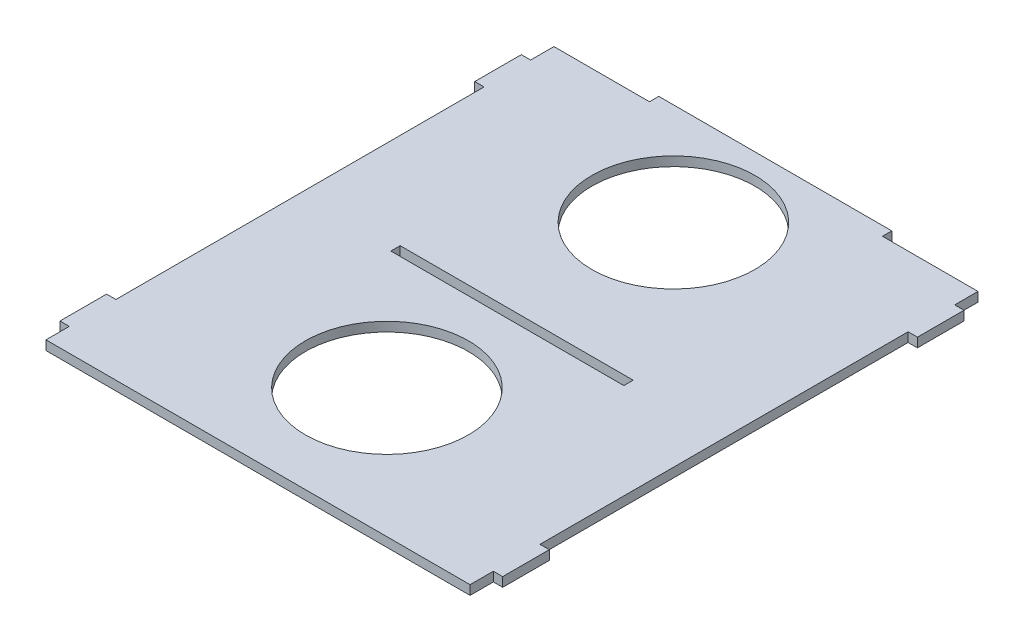
ISO-10303-21;
HEADER;
FILE_DESCRIPTION(('STEP AP214'),'2;1');
FILE_NAME('part.step','',(''),(''),'','','');
FILE_SCHEMA(('AUTOMOTIVE_DESIGN { 1 0 10303 214 1 1 1 1 }'));
ENDSEC;
DATA;
#1=APPLICATION_CONTEXT('core data for automotive mechanical design processes');
#2=APPLICATION_PROTOCOL_DEFINITION('international standard','automotive_design',2000,#1);
#3=PRODUCT_CONTEXT('',#1,'mechanical');
#4=PRODUCT('Part','Part','',(#3));
#5=PRODUCT_RELATED_PRODUCT_CATEGORY('part','',(#4));
#6=PRODUCT_DEFINITION_FORMATION('','',#4);
#7=PRODUCT_DEFINITION_CONTEXT('part definition',#1,'design');
#8=PRODUCT_DEFINITION('design','',#6,#7);
#9=PRODUCT_DEFINITION_SHAPE('','',#8);
#10=(LENGTH_UNIT() NAMED_UNIT(*) SI_UNIT(.MILLI.,.METRE.));
#11=(NAMED_UNIT(*) PLANE_ANGLE_UNIT() SI_UNIT($,.RADIAN.));
#12=(NAMED_UNIT(*) SI_UNIT($,.STERADIAN.) SOLID_ANGLE_UNIT());
#13=UNCERTAINTY_MEASURE_WITH_UNIT(LENGTH_MEASURE(1.E-05),#10,'distance_accuracy_value','');
#14=(GEOMETRIC_REPRESENTATION_CONTEXT(3) GLOBAL_UNCERTAINTY_ASSIGNED_CONTEXT((#13)) GLOBAL_UNIT_ASSIGNED_CONTEXT((#10,
#11,#12)) REPRESENTATION_CONTEXT('',''));
#15=CARTESIAN_POINT('',(0.,0.,0.));
#16=DIRECTION('',(0.,0.,1.));
#17=DIRECTION('',(1.,0.,0.));
#18=AXIS2_PLACEMENT_3D('',#15,#16,#17);
#19=CARTESIAN_POINT('',(0.,4.,0.));
#20=DIRECTION('',(0.,-1.,0.));
#21=DIRECTION('',(0.,0.,-1.));
#22=AXIS2_PLACEMENT_3D('',#19,#20,#21);
#23=PLANE('',#22);
#24=DIRECTION('',(0.,0.,1.));
#25=VECTOR('',#24,1.);
#26=CARTESIAN_POINT('',(-90.9999999999996,4.,-70.0000000000444));
#27=LINE('',#26,#25);
#28=CARTESIAN_POINT('',(-90.9999999999996,4.,-80.000000000045));
#29=VERTEX_POINT('',#28);
#30=CARTESIAN_POINT('',(-90.9999999999996,4.,-70.0000000000444));
#31=VERTEX_POINT('',#30);
#32=EDGE_CURVE('E260',#29,#31,#27,.T.);
#33=ORIENTED_EDGE('',*,*,#32,.T.);
#34=DIRECTION('',(-1.,0.,0.));
#35=VECTOR('',#34,1.);
#36=CARTESIAN_POINT('',(-90.9999999999996,4.,-70.0000000000444));
#37=LINE('',#36,#35);
#38=CARTESIAN_POINT('',(-95.,4.,-70.0000000000444));
#39=VERTEX_POINT('',#38);
#40=EDGE_CURVE('E263',#31,#39,#37,.T.);
#41=ORIENTED_EDGE('',*,*,#40,.T.);
#42=DIRECTION('',(0.,0.,1.));
#43=VECTOR('',#42,1.);
#44=CARTESIAN_POINT('',(-95.,4.,-70.0000000000444));
#45=LINE('',#44,#43);
#46=CARTESIAN_POINT('',(-95.,4.,-50.0000000000446));
#47=VERTEX_POINT('',#46);
#48=EDGE_CURVE('E266',#39,#47,#45,.T.);
#49=ORIENTED_EDGE('',*,*,#48,.T.);
#50=DIRECTION('',(1.,0.,0.));
#51=VECTOR('',#50,1.);
#52=CARTESIAN_POINT('',(-95.,4.,-50.0000000000446));
#53=LINE('',#52,#51);
#54=CARTESIAN_POINT('',(-90.9999999999996,4.,-50.0000000000446));
#55=VERTEX_POINT('',#54);
#56=EDGE_CURVE('E268',#47,#55,#53,.T.);
#57=ORIENTED_EDGE('',*,*,#56,.T.);
#58=DIRECTION('',(0.,0.,1.));
#59=VECTOR('',#58,1.);
#60=CARTESIAN_POINT('',(-90.9999999999996,4.,107.999999999955));
#61=LINE('',#60,#59);
#62=CARTESIAN_POINT('',(-90.9999999999996,4.,107.999999999955));
#63=VERTEX_POINT('',#62);
#64=EDGE_CURVE('E270',#55,#63,#61,.T.);
#65=ORIENTED_EDGE('',*,*,#64,.T.);
#66=DIRECTION('',(-1.,0.,0.));
#67=VECTOR('',#66,1.);
#68=CARTESIAN_POINT('',(-90.9999999999996,4.,107.999999999955));
#69=LINE('',#68,#67);
#70=CARTESIAN_POINT('',(-94.9999999999999,4.,107.999999999955));
#71=VERTEX_POINT('',#70);
#72=EDGE_CURVE('E272',#63,#71,#69,.T.);
#73=ORIENTED_EDGE('',*,*,#72,.T.);
#74=DIRECTION('',(0.,0.,1.));
#75=VECTOR('',#74,1.);
#76=CARTESIAN_POINT('',(-94.9999999999999,4.,107.999999999955));
#77=LINE('',#76,#75);
#78=CARTESIAN_POINT('',(-94.9999999999999,4.,127.999999999955));
#79=VERTEX_POINT('',#78);
#80=EDGE_CURVE('E274',#71,#79,#77,.T.);
#81=ORIENTED_EDGE('',*,*,#80,.T.);
#82=DIRECTION('',(1.,0.,0.));
#83=VECTOR('',#82,1.);
#84=CARTESIAN_POINT('',(-94.9999999999999,4.,127.999999999955));
#85=LINE('',#84,#83);
#86=CARTESIAN_POINT('',(-90.9999999999996,4.,127.999999999955));
#87=VERTEX_POINT('',#86);
#88=EDGE_CURVE('E276',#79,#87,#85,.T.);
#89=ORIENTED_EDGE('',*,*,#88,.T.);
#90=DIRECTION('',(0.,0.,1.));
#91=VECTOR('',#90,1.);
#92=CARTESIAN_POINT('',(-90.9999999999996,4.,137.999999999955));
#93=LINE('',#92,#91);
#94=CARTESIAN_POINT('',(-90.9999999999996,4.,137.999999999955));
#95=VERTEX_POINT('',#94);
#96=EDGE_CURVE('E278',#87,#95,#93,.T.);
#97=ORIENTED_EDGE('',*,*,#96,.T.);
#98=DIRECTION('',(1.,0.,0.));
#99=VECTOR('',#98,1.);
#100=CARTESIAN_POINT('',(-90.9999999999996,4.,137.999999999955));
#101=LINE('',#100,#99);
#102=CARTESIAN_POINT('',(90.9999999999996,4.,137.999999999955));
#103=VERTEX_POINT('',#102);
#104=EDGE_CURVE('E280',#95,#103,#101,.T.);
#105=ORIENTED_EDGE('',*,*,#104,.T.);
#106=DIRECTION('',(0.,0.,-1.));
#107=VECTOR('',#106,1.);
#108=CARTESIAN_POINT('',(90.9999999999996,4.,137.999999999955));
#109=LINE('',#108,#107);
#110=CARTESIAN_POINT('',(90.9999999999996,4.,127.999999999955));
#111=VERTEX_POINT('',#110);
#112=EDGE_CURVE('E282',#103,#111,#109,.T.);
#113=ORIENTED_EDGE('',*,*,#112,.T.);
#114=DIRECTION('',(1.,0.,0.));
#115=VECTOR('',#114,1.);
#116=CARTESIAN_POINT('',(95.,4.,127.999999999955));
#117=LINE('',#116,#115);
#118=CARTESIAN_POINT('',(95.,4.,127.999999999955));
#119=VERTEX_POINT('',#118);
#120=EDGE_CURVE('E284',#111,#119,#117,.T.);
#121=ORIENTED_EDGE('',*,*,#120,.T.);
#122=DIRECTION('',(0.,0.,-1.));
#123=VECTOR('',#122,1.);
#124=CARTESIAN_POINT('',(95.,4.,107.999999999955));
#125=LINE('',#124,#123);
#126=CARTESIAN_POINT('',(95.,4.,107.999999999955));
#127=VERTEX_POINT('',#126);
#128=EDGE_CURVE('E286',#119,#127,#125,.T.);
#129=ORIENTED_EDGE('',*,*,#128,.T.);
#130=DIRECTION('',(-1.,0.,0.));
#131=VECTOR('',#130,1.);
#132=CARTESIAN_POINT('',(90.9999999999996,4.,107.999999999955));
#133=LINE('',#132,#131);
#134=CARTESIAN_POINT('',(90.9999999999996,4.,107.999999999955));
#135=VERTEX_POINT('',#134);
#136=EDGE_CURVE('E288',#127,#135,#133,.T.);
#137=ORIENTED_EDGE('',*,*,#136,.T.);
#138=DIRECTION('',(0.,0.,-1.));
#139=VECTOR('',#138,1.);
#140=CARTESIAN_POINT('',(90.9999999999996,4.,107.999999999955));
#141=LINE('',#140,#139);
#142=CARTESIAN_POINT('',(90.9999999999996,4.,-50.0000000000446));
#143=VERTEX_POINT('',#142);
#144=EDGE_CURVE('E290',#135,#143,#141,.T.);
#145=ORIENTED_EDGE('',*,*,#144,.T.);
#146=DIRECTION('',(1.,0.,0.));
#147=VECTOR('',#146,1.);
#148=CARTESIAN_POINT('',(95.,4.,-50.0000000000446));
#149=LINE('',#148,#147);
#150=CARTESIAN_POINT('',(95.,4.,-50.0000000000446));
#151=VERTEX_POINT('',#150);
#152=EDGE_CURVE('E292',#143,#151,#149,.T.);
#153=ORIENTED_EDGE('',*,*,#152,.T.);
#154=DIRECTION('',(0.,0.,-1.));
#155=VECTOR('',#154,1.);
#156=CARTESIAN_POINT('',(95.,4.,-70.0000000000444));
#157=LINE('',#156,#155);
#158=CARTESIAN_POINT('',(95.,4.,-70.0000000000444));
#159=VERTEX_POINT('',#158);
#160=EDGE_CURVE('E294',#151,#159,#157,.T.);
#161=ORIENTED_EDGE('',*,*,#160,.T.);
#162=DIRECTION('',(-1.,0.,0.));
#163=VECTOR('',#162,1.);
#164=CARTESIAN_POINT('',(90.9999999999996,4.,-70.0000000000444));
#165=LINE('',#164,#163);
#166=CARTESIAN_POINT('',(90.9999999999996,4.,-70.0000000000444));
#167=VERTEX_POINT('',#166);
#168=EDGE_CURVE('E296',#159,#167,#165,.T.);
#169=ORIENTED_EDGE('',*,*,#168,.T.);
#170=DIRECTION('',(0.,0.,-1.));
#171=VECTOR('',#170,1.);
#172=CARTESIAN_POINT('',(90.9999999999996,4.,-70.0000000000444));
#173=LINE('',#172,#171);
#174=CARTESIAN_POINT('',(90.9999999999996,4.,-80.000000000045));
#175=VERTEX_POINT('',#174);
#176=EDGE_CURVE('E298',#167,#175,#173,.T.);
#177=ORIENTED_EDGE('',*,*,#176,.T.);
#178=DIRECTION('',(-1.,0.,0.));
#179=VECTOR('',#178,1.);
#180=CARTESIAN_POINT('',(50.,4.,-80.000000000045));
#181=LINE('',#180,#179);
#182=CARTESIAN_POINT('',(50.,4.,-80.000000000045));
#183=VERTEX_POINT('',#182);
#184=EDGE_CURVE('E300',#175,#183,#181,.T.);
#185=ORIENTED_EDGE('',*,*,#184,.T.);
#186=DIRECTION('',(0.,0.,-1.));
#187=VECTOR('',#186,1.);
#188=CARTESIAN_POINT('',(50.,4.,-84.000000000045));
#189=LINE('',#188,#187);
#190=CARTESIAN_POINT('',(50.,4.,-84.000000000045));
#191=VERTEX_POINT('',#190);
#192=EDGE_CURVE('E302',#183,#191,#189,.T.);
#193=ORIENTED_EDGE('',*,*,#192,.T.);
#194=DIRECTION('',(-1.,0.,0.));
#195=VECTOR('',#194,1.);
#196=CARTESIAN_POINT('',(-50.,4.,-84.000000000045));
#197=LINE('',#196,#195);
#198=CARTESIAN_POINT('',(-50.,4.,-84.000000000045));
#199=VERTEX_POINT('',#198);
#200=EDGE_CURVE('E304',#191,#199,#197,.T.);
#201=ORIENTED_EDGE('',*,*,#200,.T.);
#202=DIRECTION('',(0.,0.,1.));
#203=VECTOR('',#202,1.);
#204=CARTESIAN_POINT('',(-50.,4.,-84.000000000045));
#205=LINE('',#204,#203);
#206=CARTESIAN_POINT('',(-50.,4.,-80.000000000045));
#207=VERTEX_POINT('',#206);
#208=EDGE_CURVE('E306',#199,#207,#205,.T.);
#209=ORIENTED_EDGE('',*,*,#208,.T.);
#210=DIRECTION('',(-1.,0.,0.));
#211=VECTOR('',#210,1.);
#212=CARTESIAN_POINT('',(-90.9999999999996,4.,-80.000000000045));
#213=LINE('',#212,#211);
#214=EDGE_CURVE('E308',#207,#29,#213,.T.);
#215=ORIENTED_EDGE('',*,*,#214,.T.);
#216=EDGE_LOOP('',(#33,#41,#49,#57,#65,#73,#81,#89,#97,#105,#113,#121,#129,#137,#145,#153,#161,
#169,#177,#185,#193,#201,#209,#215));
#217=FACE_BOUND('',#216,.T.);
#218=DIRECTION('',(0.,0.,1.));
#219=VECTOR('',#218,1.);
#220=CARTESIAN_POINT('',(-50.,4.,26.9999999999551));
#221=LINE('',#220,#219);
#222=CARTESIAN_POINT('',(-50.,4.,26.9999999999551));
#223=VERTEX_POINT('',#222);
#224=CARTESIAN_POINT('',(-50.,4.,30.9999999999551));
#225=VERTEX_POINT('',#224);
#226=EDGE_CURVE('E221',#223,#225,#221,.T.);
#227=ORIENTED_EDGE('',*,*,#226,.F.);
#228=DIRECTION('',(-1.,0.,0.));
#229=VECTOR('',#228,1.);
#230=CARTESIAN_POINT('',(-50.,4.,26.9999999999551));
#231=LINE('',#230,#229);
#232=CARTESIAN_POINT('',(50.,4.,26.9999999999551));
#233=VERTEX_POINT('',#232);
#234=EDGE_CURVE('E244',#233,#223,#231,.T.);
#235=ORIENTED_EDGE('',*,*,#234,.F.);
#236=DIRECTION('',(0.,0.,-1.));
#237=VECTOR('',#236,1.);
#238=CARTESIAN_POINT('',(50.,4.,26.9999999999551));
#239=LINE('',#238,#237);
#240=CARTESIAN_POINT('',(50.,4.,30.9999999999551));
#241=VERTEX_POINT('',#240);
#242=EDGE_CURVE('E242',#241,#233,#239,.T.);
#243=ORIENTED_EDGE('',*,*,#242,.F.);
#244=DIRECTION('',(1.,0.,0.));
#245=VECTOR('',#244,1.);
#246=CARTESIAN_POINT('',(-50.,4.,30.9999999999551));
#247=LINE('',#246,#245);
#248=EDGE_CURVE('E229',#225,#241,#247,.T.);
#249=ORIENTED_EDGE('',*,*,#248,.F.);
#250=EDGE_LOOP('',(#227,#235,#243,#249));
#251=FACE_BOUND('',#250,.T.);
#252=CARTESIAN_POINT('',(0.,4.,-40.2612435585554));
#253=DIRECTION('',(0.,1.,0.));
#254=DIRECTION('',(0.,0.,1.));
#255=AXIS2_PLACEMENT_3D('',#252,#253,#254);
#256=CIRCLE('',#255,35.);
#257=CARTESIAN_POINT('',(0.,4.,-5.26124355855541));
#258=VERTEX_POINT('',#257);
#259=EDGE_CURVE('E250',#258,#258,#256,.T.);
#260=ORIENTED_EDGE('',*,*,#259,.F.);
#261=EDGE_LOOP('',(#260));
#262=FACE_BOUND('',#261,.T.);
#263=CARTESIAN_POINT('',(-1.94289029309402E-13,4.,82.6829730301782));
#264=DIRECTION('',(0.,1.,0.));
#265=DIRECTION('',(0.,0.,1.));
#266=AXIS2_PLACEMENT_3D('',#263,#264,#265);
#267=CIRCLE('',#266,35.);
#268=CARTESIAN_POINT('',(-1.94289029309402E-13,4.,117.682973030178));
#269=VERTEX_POINT('',#268);
#270=EDGE_CURVE('E809',#269,#269,#267,.T.);
#271=ORIENTED_EDGE('',*,*,#270,.F.);
#272=EDGE_LOOP('',(#271));
#273=FACE_BOUND('',#272,.T.);
#274=ADVANCED_FACE('F36',(#217,#251,#262,#273),#23,.F.);
#275=CARTESIAN_POINT('',(0.,0.,0.));
#276=DIRECTION('',(0.,-1.,0.));
#277=DIRECTION('',(0.,0.,-1.));
#278=AXIS2_PLACEMENT_3D('',#275,#276,#277);
#279=PLANE('',#278);
#280=CARTESIAN_POINT('',(0.,0.,-40.2612435585554));
#281=DIRECTION('',(0.,1.,0.));
#282=DIRECTION('',(0.,0.,1.));
#283=AXIS2_PLACEMENT_3D('',#280,#281,#282);
#284=CIRCLE('',#283,35.);
#285=CARTESIAN_POINT('',(0.,0.,-5.26124355855541));
#286=VERTEX_POINT('',#285);
#287=EDGE_CURVE('E815',#286,#286,#284,.T.);
#288=ORIENTED_EDGE('',*,*,#287,.T.);
#289=EDGE_LOOP('',(#288));
#290=FACE_BOUND('',#289,.T.);
#291=DIRECTION('',(0.,0.,1.));
#292=VECTOR('',#291,1.);
#293=CARTESIAN_POINT('',(-90.9999999999996,0.,-70.0000000000444));
#294=LINE('',#293,#292);
#295=CARTESIAN_POINT('',(-90.9999999999996,0.,-80.000000000045));
#296=VERTEX_POINT('',#295);
#297=CARTESIAN_POINT('',(-90.9999999999996,0.,-70.0000000000444));
#298=VERTEX_POINT('',#297);
#299=EDGE_CURVE('E237',#296,#298,#294,.T.);
#300=ORIENTED_EDGE('',*,*,#299,.F.);
#301=DIRECTION('',(-1.,0.,0.));
#302=VECTOR('',#301,1.);
#303=CARTESIAN_POINT('',(-90.9999999999996,0.,-80.000000000045));
#304=LINE('',#303,#302);
#305=CARTESIAN_POINT('',(-50.,0.,-80.000000000045));
#306=VERTEX_POINT('',#305);
#307=EDGE_CURVE('E264',#306,#296,#304,.T.);
#308=ORIENTED_EDGE('',*,*,#307,.F.);
#309=DIRECTION('',(0.,0.,1.));
#310=VECTOR('',#309,1.);
#311=CARTESIAN_POINT('',(-50.,0.,-84.000000000045));
#312=LINE('',#311,#310);
#313=CARTESIAN_POINT('',(-50.,0.,-84.000000000045));
#314=VERTEX_POINT('',#313);
#315=EDGE_CURVE('E355',#314,#306,#312,.T.);
#316=ORIENTED_EDGE('',*,*,#315,.F.);
#317=DIRECTION('',(-1.,0.,0.));
#318=VECTOR('',#317,1.);
#319=CARTESIAN_POINT('',(-50.,0.,-84.000000000045));
#320=LINE('',#319,#318);
#321=CARTESIAN_POINT('',(50.,0.,-84.000000000045));
#322=VERTEX_POINT('',#321);
#323=EDGE_CURVE('E353',#322,#314,#320,.T.);
#324=ORIENTED_EDGE('',*,*,#323,.F.);
#325=DIRECTION('',(0.,0.,-1.));
#326=VECTOR('',#325,1.);
#327=CARTESIAN_POINT('',(50.,0.,-84.000000000045));
#328=LINE('',#327,#326);
#329=CARTESIAN_POINT('',(50.,0.,-80.000000000045));
#330=VERTEX_POINT('',#329);
#331=EDGE_CURVE('E351',#330,#322,#328,.T.);
#332=ORIENTED_EDGE('',*,*,#331,.F.);
#333=DIRECTION('',(-1.,0.,0.));
#334=VECTOR('',#333,1.);
#335=CARTESIAN_POINT('',(50.,0.,-80.000000000045));
#336=LINE('',#335,#334);
#337=CARTESIAN_POINT('',(90.9999999999996,0.,-80.000000000045));
#338=VERTEX_POINT('',#337);
#339=EDGE_CURVE('E349',#338,#330,#336,.T.);
#340=ORIENTED_EDGE('',*,*,#339,.F.);
#341=DIRECTION('',(0.,0.,-1.));
#342=VECTOR('',#341,1.);
#343=CARTESIAN_POINT('',(90.9999999999996,0.,-70.0000000000444));
#344=LINE('',#343,#342);
#345=CARTESIAN_POINT('',(90.9999999999996,0.,-70.0000000000444));
#346=VERTEX_POINT('',#345);
#347=EDGE_CURVE('E347',#346,#338,#344,.T.);
#348=ORIENTED_EDGE('',*,*,#347,.F.);
#349=DIRECTION('',(-1.,0.,0.));
#350=VECTOR('',#349,1.);
#351=CARTESIAN_POINT('',(90.9999999999996,0.,-70.0000000000444));
#352=LINE('',#351,#350);
#353=CARTESIAN_POINT('',(95.,0.,-70.0000000000444));
#354=VERTEX_POINT('',#353);
#355=EDGE_CURVE('E345',#354,#346,#352,.T.);
#356=ORIENTED_EDGE('',*,*,#355,.F.);
#357=DIRECTION('',(0.,0.,-1.));
#358=VECTOR('',#357,1.);
#359=CARTESIAN_POINT('',(95.,0.,-70.0000000000444));
#360=LINE('',#359,#358);
#361=CARTESIAN_POINT('',(95.,0.,-50.0000000000446));
#362=VERTEX_POINT('',#361);
#363=EDGE_CURVE('E343',#362,#354,#360,.T.);
#364=ORIENTED_EDGE('',*,*,#363,.F.);
#365=DIRECTION('',(1.,0.,0.));
#366=VECTOR('',#365,1.);
#367=CARTESIAN_POINT('',(95.,0.,-50.0000000000446));
#368=LINE('',#367,#366);
#369=CARTESIAN_POINT('',(90.9999999999996,0.,-50.0000000000446));
#370=VERTEX_POINT('',#369);
#371=EDGE_CURVE('E341',#370,#362,#368,.T.);
#372=ORIENTED_EDGE('',*,*,#371,.F.);
#373=DIRECTION('',(0.,0.,-1.));
#374=VECTOR('',#373,1.);
#375=CARTESIAN_POINT('',(90.9999999999996,0.,107.999999999955));
#376=LINE('',#375,#374);
#377=CARTESIAN_POINT('',(90.9999999999996,0.,107.999999999955));
#378=VERTEX_POINT('',#377);
#379=EDGE_CURVE('E339',#378,#370,#376,.T.);
#380=ORIENTED_EDGE('',*,*,#379,.F.);
#381=DIRECTION('',(-1.,0.,0.));
#382=VECTOR('',#381,1.);
#383=CARTESIAN_POINT('',(90.9999999999996,0.,107.999999999955));
#384=LINE('',#383,#382);
#385=CARTESIAN_POINT('',(95.,0.,107.999999999955));
#386=VERTEX_POINT('',#385);
#387=EDGE_CURVE('E337',#386,#378,#384,.T.);
#388=ORIENTED_EDGE('',*,*,#387,.F.);
#389=DIRECTION('',(0.,0.,-1.));
#390=VECTOR('',#389,1.);
#391=CARTESIAN_POINT('',(95.,0.,107.999999999955));
#392=LINE('',#391,#390);
#393=CARTESIAN_POINT('',(95.,0.,127.999999999955));
#394=VERTEX_POINT('',#393);
#395=EDGE_CURVE('E335',#394,#386,#392,.T.);
#396=ORIENTED_EDGE('',*,*,#395,.F.);
#397=DIRECTION('',(1.,0.,0.));
#398=VECTOR('',#397,1.);
#399=CARTESIAN_POINT('',(95.,0.,127.999999999955));
#400=LINE('',#399,#398);
#401=CARTESIAN_POINT('',(90.9999999999996,0.,127.999999999955));
#402=VERTEX_POINT('',#401);
#403=EDGE_CURVE('E333',#402,#394,#400,.T.);
#404=ORIENTED_EDGE('',*,*,#403,.F.);
#405=DIRECTION('',(0.,0.,-1.));
#406=VECTOR('',#405,1.);
#407=CARTESIAN_POINT('',(90.9999999999996,0.,137.999999999955));
#408=LINE('',#407,#406);
#409=CARTESIAN_POINT('',(90.9999999999996,0.,137.999999999955));
#410=VERTEX_POINT('',#409);
#411=EDGE_CURVE('E331',#410,#402,#408,.T.);
#412=ORIENTED_EDGE('',*,*,#411,.F.);
#413=DIRECTION('',(1.,0.,0.));
#414=VECTOR('',#413,1.);
#415=CARTESIAN_POINT('',(-90.9999999999996,0.,137.999999999955));
#416=LINE('',#415,#414);
#417=CARTESIAN_POINT('',(-90.9999999999996,0.,137.999999999955));
#418=VERTEX_POINT('',#417);
#419=EDGE_CURVE('E329',#418,#410,#416,.T.);
#420=ORIENTED_EDGE('',*,*,#419,.F.);
#421=DIRECTION('',(0.,0.,1.));
#422=VECTOR('',#421,1.);
#423=CARTESIAN_POINT('',(-90.9999999999996,0.,137.999999999955));
#424=LINE('',#423,#422);
#425=CARTESIAN_POINT('',(-90.9999999999996,0.,127.999999999955));
#426=VERTEX_POINT('',#425);
#427=EDGE_CURVE('E327',#426,#418,#424,.T.);
#428=ORIENTED_EDGE('',*,*,#427,.F.);
#429=DIRECTION('',(1.,0.,0.));
#430=VECTOR('',#429,1.);
#431=CARTESIAN_POINT('',(-94.9999999999999,0.,127.999999999955));
#432=LINE('',#431,#430);
#433=CARTESIAN_POINT('',(-94.9999999999999,0.,127.999999999955));
#434=VERTEX_POINT('',#433);
#435=EDGE_CURVE('E325',#434,#426,#432,.T.);
#436=ORIENTED_EDGE('',*,*,#435,.F.);
#437=DIRECTION('',(0.,0.,1.));
#438=VECTOR('',#437,1.);
#439=CARTESIAN_POINT('',(-94.9999999999999,0.,107.999999999955));
#440=LINE('',#439,#438);
#441=CARTESIAN_POINT('',(-94.9999999999999,0.,107.999999999955));
#442=VERTEX_POINT('',#441);
#443=EDGE_CURVE('E323',#442,#434,#440,.T.);
#444=ORIENTED_EDGE('',*,*,#443,.F.);
#445=DIRECTION('',(-1.,0.,0.));
#446=VECTOR('',#445,1.);
#447=CARTESIAN_POINT('',(-90.9999999999996,0.,107.999999999955));
#448=LINE('',#447,#446);
#449=CARTESIAN_POINT('',(-90.9999999999996,0.,107.999999999955));
#450=VERTEX_POINT('',#449);
#451=EDGE_CURVE('E321',#450,#442,#448,.T.);
#452=ORIENTED_EDGE('',*,*,#451,.F.);
#453=DIRECTION('',(0.,0.,1.));
#454=VECTOR('',#453,1.);
#455=CARTESIAN_POINT('',(-90.9999999999996,0.,107.999999999955));
#456=LINE('',#455,#454);
#457=CARTESIAN_POINT('',(-90.9999999999996,0.,-50.0000000000446));
#458=VERTEX_POINT('',#457);
#459=EDGE_CURVE('E319',#458,#450,#456,.T.);
#460=ORIENTED_EDGE('',*,*,#459,.F.);
#461=DIRECTION('',(1.,0.,0.));
#462=VECTOR('',#461,1.);
#463=CARTESIAN_POINT('',(-95.,0.,-50.0000000000446));
#464=LINE('',#463,#462);
#465=CARTESIAN_POINT('',(-95.,0.,-50.0000000000446));
#466=VERTEX_POINT('',#465);
#467=EDGE_CURVE('E317',#466,#458,#464,.T.);
#468=ORIENTED_EDGE('',*,*,#467,.F.);
#469=DIRECTION('',(0.,0.,1.));
#470=VECTOR('',#469,1.);
#471=CARTESIAN_POINT('',(-95.,0.,-70.0000000000444));
#472=LINE('',#471,#470);
#473=CARTESIAN_POINT('',(-95.,0.,-70.0000000000444));
#474=VERTEX_POINT('',#473);
#475=EDGE_CURVE('E315',#474,#466,#472,.T.);
#476=ORIENTED_EDGE('',*,*,#475,.F.);
#477=DIRECTION('',(-1.,0.,0.));
#478=VECTOR('',#477,1.);
#479=CARTESIAN_POINT('',(-90.9999999999996,0.,-70.0000000000444));
#480=LINE('',#479,#478);
#481=EDGE_CURVE('E313',#298,#474,#480,.T.);
#482=ORIENTED_EDGE('',*,*,#481,.F.);
#483=EDGE_LOOP('',(#300,#308,#316,#324,#332,#340,#348,#356,#364,#372,#380,#388,#396,#404,#412,
#420,#428,#436,#444,#452,#460,#468,#476,#482));
#484=FACE_BOUND('',#483,.T.);
#485=DIRECTION('',(-1.,0.,0.));
#486=VECTOR('',#485,1.);
#487=CARTESIAN_POINT('',(-50.,0.,26.9999999999551));
#488=LINE('',#487,#486);
#489=CARTESIAN_POINT('',(50.,0.,26.9999999999551));
#490=VERTEX_POINT('',#489);
#491=CARTESIAN_POINT('',(-50.,0.,26.9999999999551));
#492=VERTEX_POINT('',#491);
#493=EDGE_CURVE('E230',#490,#492,#488,.T.);
#494=ORIENTED_EDGE('',*,*,#493,.T.);
#495=DIRECTION('',(0.,0.,1.));
#496=VECTOR('',#495,1.);
#497=CARTESIAN_POINT('',(-50.,0.,26.9999999999551));
#498=LINE('',#497,#496);
#499=CARTESIAN_POINT('',(-50.,0.,30.9999999999551));
#500=VERTEX_POINT('',#499);
#501=EDGE_CURVE('E59',#492,#500,#498,.T.);
#502=ORIENTED_EDGE('',*,*,#501,.T.);
#503=DIRECTION('',(1.,0.,0.));
#504=VECTOR('',#503,1.);
#505=CARTESIAN_POINT('',(-50.,0.,30.9999999999551));
#506=LINE('',#505,#504);
#507=CARTESIAN_POINT('',(50.,0.,30.9999999999551));
#508=VERTEX_POINT('',#507);
#509=EDGE_CURVE('E236',#500,#508,#506,.T.);
#510=ORIENTED_EDGE('',*,*,#509,.T.);
#511=DIRECTION('',(0.,0.,-1.));
#512=VECTOR('',#511,1.);
#513=CARTESIAN_POINT('',(50.,0.,26.9999999999551));
#514=LINE('',#513,#512);
#515=EDGE_CURVE('E252',#508,#490,#514,.T.);
#516=ORIENTED_EDGE('',*,*,#515,.T.);
#517=EDGE_LOOP('',(#494,#502,#510,#516));
#518=FACE_BOUND('',#517,.T.);
#519=CARTESIAN_POINT('',(-1.94289029309402E-13,0.,82.6829730301782));
#520=DIRECTION('',(0.,1.,0.));
#521=DIRECTION('',(0.,0.,1.));
#522=AXIS2_PLACEMENT_3D('',#519,#520,#521);
#523=CIRCLE('',#522,35.);
#524=CARTESIAN_POINT('',(-1.94289029309402E-13,0.,117.682973030178));
#525=VERTEX_POINT('',#524);
#526=EDGE_CURVE('E812',#525,#525,#523,.T.);
#527=ORIENTED_EDGE('',*,*,#526,.T.);
#528=EDGE_LOOP('',(#527));
#529=FACE_BOUND('',#528,.T.);
#530=ADVANCED_FACE('F433',(#290,#484,#518,#529),#279,.T.);
#531=CARTESIAN_POINT('',(-90.9999999999996,4.,-70.0000000000444));
#532=DIRECTION('',(1.,0.,0.));
#533=DIRECTION('',(0.,0.,-1.));
#534=AXIS2_PLACEMENT_3D('',#531,#532,#533);
#535=PLANE('',#534);
#536=ORIENTED_EDGE('',*,*,#299,.T.);
#537=DIRECTION('',(0.,-1.,0.));
#538=VECTOR('',#537,1.);
#539=CARTESIAN_POINT('',(-90.9999999999996,4.,-70.0000000000444));
#540=LINE('',#539,#538);
#541=EDGE_CURVE('E11',#31,#298,#540,.T.);
#542=ORIENTED_EDGE('',*,*,#541,.F.);
#543=ORIENTED_EDGE('',*,*,#32,.F.);
#544=DIRECTION('',(0.,-1.,0.));
#545=VECTOR('',#544,1.);
#546=CARTESIAN_POINT('',(-90.9999999999996,4.,-80.000000000045));
#547=LINE('',#546,#545);
#548=EDGE_CURVE('E310',#29,#296,#547,.T.);
#549=ORIENTED_EDGE('',*,*,#548,.T.);
#550=EDGE_LOOP('',(#536,#542,#543,#549));
#551=FACE_BOUND('',#550,.T.);
#552=ADVANCED_FACE('F38',(#551),#535,.F.);
#553=CARTESIAN_POINT('',(-90.9999999999996,4.,-70.0000000000444));
#554=DIRECTION('',(0.,0.,1.));
#555=DIRECTION('',(1.,0.,0.));
#556=AXIS2_PLACEMENT_3D('',#553,#554,#555);
#557=PLANE('',#556);
#558=ORIENTED_EDGE('',*,*,#481,.T.);
#559=DIRECTION('',(0.,-1.,0.));
#560=VECTOR('',#559,1.);
#561=CARTESIAN_POINT('',(-95.,4.,-70.0000000000444));
#562=LINE('',#561,#560);
#563=EDGE_CURVE('E44',#39,#474,#562,.T.);
#564=ORIENTED_EDGE('',*,*,#563,.F.);
#565=ORIENTED_EDGE('',*,*,#40,.F.);
#566=ORIENTED_EDGE('',*,*,#541,.T.);
#567=EDGE_LOOP('',(#558,#564,#565,#566));
#568=FACE_BOUND('',#567,.T.);
#569=ADVANCED_FACE('F450',(#568),#557,.F.);
#570=CARTESIAN_POINT('',(-95.,4.,-70.0000000000444));
#571=DIRECTION('',(1.,0.,0.));
#572=DIRECTION('',(0.,0.,-1.));
#573=AXIS2_PLACEMENT_3D('',#570,#571,#572);
#574=PLANE('',#573);
#575=ORIENTED_EDGE('',*,*,#475,.T.);
#576=DIRECTION('',(0.,-1.,0.));
#577=VECTOR('',#576,1.);
#578=CARTESIAN_POINT('',(-95.,4.,-50.0000000000446));
#579=LINE('',#578,#577);
#580=EDGE_CURVE('E420',#47,#466,#579,.T.);
#581=ORIENTED_EDGE('',*,*,#580,.F.);
#582=ORIENTED_EDGE('',*,*,#48,.F.);
#583=ORIENTED_EDGE('',*,*,#563,.T.);
#584=EDGE_LOOP('',(#575,#581,#582,#583));
#585=FACE_BOUND('',#584,.T.);
#586=ADVANCED_FACE('F427',(#585),#574,.F.);
#587=CARTESIAN_POINT('',(-95.,4.,-50.0000000000446));
#588=DIRECTION('',(0.,0.,-1.));
#589=DIRECTION('',(-1.,0.,0.));
#590=AXIS2_PLACEMENT_3D('',#587,#588,#589);
#591=PLANE('',#590);
#592=ORIENTED_EDGE('',*,*,#467,.T.);
#593=DIRECTION('',(0.,-1.,0.));
#594=VECTOR('',#593,1.);
#595=CARTESIAN_POINT('',(-90.9999999999996,4.,-50.0000000000446));
#596=LINE('',#595,#594);
#597=EDGE_CURVE('E417',#55,#458,#596,.T.);
#598=ORIENTED_EDGE('',*,*,#597,.F.);
#599=ORIENTED_EDGE('',*,*,#56,.F.);
#600=ORIENTED_EDGE('',*,*,#580,.T.);
#601=EDGE_LOOP('',(#592,#598,#599,#600));
#602=FACE_BOUND('',#601,.T.);
#603=ADVANCED_FACE('F439',(#602),#591,.F.);
#604=CARTESIAN_POINT('',(-90.9999999999996,4.,107.999999999955));
#605=DIRECTION('',(1.,0.,0.));
#606=DIRECTION('',(0.,0.,-1.));
#607=AXIS2_PLACEMENT_3D('',#604,#605,#606);
#608=PLANE('',#607);
#609=ORIENTED_EDGE('',*,*,#459,.T.);
#610=DIRECTION('',(0.,-1.,0.));
#611=VECTOR('',#610,1.);
#612=CARTESIAN_POINT('',(-90.9999999999996,4.,107.999999999955));
#613=LINE('',#612,#611);
#614=EDGE_CURVE('E414',#63,#450,#613,.T.);
#615=ORIENTED_EDGE('',*,*,#614,.F.);
#616=ORIENTED_EDGE('',*,*,#64,.F.);
#617=ORIENTED_EDGE('',*,*,#597,.T.);
#618=EDGE_LOOP('',(#609,#615,#616,#617));
#619=FACE_BOUND('',#618,.T.);
#620=ADVANCED_FACE('F443',(#619),#608,.F.);
#621=CARTESIAN_POINT('',(-90.9999999999996,4.,107.999999999955));
#622=DIRECTION('',(0.,0.,1.));
#623=DIRECTION('',(1.,0.,0.));
#624=AXIS2_PLACEMENT_3D('',#621,#622,#623);
#625=PLANE('',#624);
#626=ORIENTED_EDGE('',*,*,#451,.T.);
#627=DIRECTION('',(0.,-1.,0.));
#628=VECTOR('',#627,1.);
#629=CARTESIAN_POINT('',(-94.9999999999999,4.,107.999999999955));
#630=LINE('',#629,#628);
#631=EDGE_CURVE('E411',#71,#442,#630,.T.);
#632=ORIENTED_EDGE('',*,*,#631,.F.);
#633=ORIENTED_EDGE('',*,*,#72,.F.);
#634=ORIENTED_EDGE('',*,*,#614,.T.);
#635=EDGE_LOOP('',(#626,#632,#633,#634));
#636=FACE_BOUND('',#635,.T.);
#637=ADVANCED_FACE('F543',(#636),#625,.F.);
#638=CARTESIAN_POINT('',(-94.9999999999999,4.,107.999999999955));
#639=DIRECTION('',(1.,0.,0.));
#640=DIRECTION('',(0.,0.,-1.));
#641=AXIS2_PLACEMENT_3D('',#638,#639,#640);
#642=PLANE('',#641);
#643=ORIENTED_EDGE('',*,*,#443,.T.);
#644=DIRECTION('',(0.,-1.,0.));
#645=VECTOR('',#644,1.);
#646=CARTESIAN_POINT('',(-94.9999999999999,4.,127.999999999955));
#647=LINE('',#646,#645);
#648=EDGE_CURVE('E408',#79,#434,#647,.T.);
#649=ORIENTED_EDGE('',*,*,#648,.F.);
#650=ORIENTED_EDGE('',*,*,#80,.F.);
#651=ORIENTED_EDGE('',*,*,#631,.T.);
#652=EDGE_LOOP('',(#643,#649,#650,#651));
#653=FACE_BOUND('',#652,.T.);
#654=ADVANCED_FACE('F541',(#653),#642,.F.);
#655=CARTESIAN_POINT('',(-94.9999999999999,4.,127.999999999955));
#656=DIRECTION('',(0.,0.,-1.));
#657=DIRECTION('',(-1.,0.,0.));
#658=AXIS2_PLACEMENT_3D('',#655,#656,#657);
#659=PLANE('',#658);
#660=ORIENTED_EDGE('',*,*,#435,.T.);
#661=DIRECTION('',(0.,-1.,0.));
#662=VECTOR('',#661,1.);
#663=CARTESIAN_POINT('',(-90.9999999999996,4.,127.999999999955));
#664=LINE('',#663,#662);
#665=EDGE_CURVE('E405',#87,#426,#664,.T.);
#666=ORIENTED_EDGE('',*,*,#665,.F.);
#667=ORIENTED_EDGE('',*,*,#88,.F.);
#668=ORIENTED_EDGE('',*,*,#648,.T.);
#669=EDGE_LOOP('',(#660,#666,#667,#668));
#670=FACE_BOUND('',#669,.T.);
#671=ADVANCED_FACE('F537',(#670),#659,.F.);
#672=CARTESIAN_POINT('',(-90.9999999999996,4.,137.999999999955));
#673=DIRECTION('',(1.,0.,0.));
#674=DIRECTION('',(0.,0.,-1.));
#675=AXIS2_PLACEMENT_3D('',#672,#673,#674);
#676=PLANE('',#675);
#677=ORIENTED_EDGE('',*,*,#427,.T.);
#678=DIRECTION('',(0.,-1.,0.));
#679=VECTOR('',#678,1.);
#680=CARTESIAN_POINT('',(-90.9999999999996,4.,137.999999999955));
#681=LINE('',#680,#679);
#682=EDGE_CURVE('E402',#95,#418,#681,.T.);
#683=ORIENTED_EDGE('',*,*,#682,.F.);
#684=ORIENTED_EDGE('',*,*,#96,.F.);
#685=ORIENTED_EDGE('',*,*,#665,.T.);
#686=EDGE_LOOP('',(#677,#683,#684,#685));
#687=FACE_BOUND('',#686,.T.);
#688=ADVANCED_FACE('F532',(#687),#676,.F.);
#689=CARTESIAN_POINT('',(-90.9999999999996,4.,137.999999999955));
#690=DIRECTION('',(0.,0.,-1.));
#691=DIRECTION('',(-1.,0.,0.));
#692=AXIS2_PLACEMENT_3D('',#689,#690,#691);
#693=PLANE('',#692);
#694=ORIENTED_EDGE('',*,*,#419,.T.);
#695=DIRECTION('',(0.,-1.,0.));
#696=VECTOR('',#695,1.);
#697=CARTESIAN_POINT('',(90.9999999999996,4.,137.999999999955));
#698=LINE('',#697,#696);
#699=EDGE_CURVE('E399',#103,#410,#698,.T.);
#700=ORIENTED_EDGE('',*,*,#699,.F.);
#701=ORIENTED_EDGE('',*,*,#104,.F.);
#702=ORIENTED_EDGE('',*,*,#682,.T.);
#703=EDGE_LOOP('',(#694,#700,#701,#702));
#704=FACE_BOUND('',#703,.T.);
#705=ADVANCED_FACE('F526',(#704),#693,.F.);
#706=CARTESIAN_POINT('',(90.9999999999996,4.,137.999999999955));
#707=DIRECTION('',(-1.,0.,0.));
#708=DIRECTION('',(0.,0.,1.));
#709=AXIS2_PLACEMENT_3D('',#706,#707,#708);
#710=PLANE('',#709);
#711=ORIENTED_EDGE('',*,*,#411,.T.);
#712=DIRECTION('',(0.,-1.,0.));
#713=VECTOR('',#712,1.);
#714=CARTESIAN_POINT('',(90.9999999999996,4.,127.999999999955));
#715=LINE('',#714,#713);
#716=EDGE_CURVE('E396',#111,#402,#715,.T.);
#717=ORIENTED_EDGE('',*,*,#716,.F.);
#718=ORIENTED_EDGE('',*,*,#112,.F.);
#719=ORIENTED_EDGE('',*,*,#699,.T.);
#720=EDGE_LOOP('',(#711,#717,#718,#719));
#721=FACE_BOUND('',#720,.T.);
#722=ADVANCED_FACE('F522',(#721),#710,.F.);
#723=CARTESIAN_POINT('',(95.,4.,127.999999999955));
#724=DIRECTION('',(0.,0.,-1.));
#725=DIRECTION('',(-1.,0.,0.));
#726=AXIS2_PLACEMENT_3D('',#723,#724,#725);
#727=PLANE('',#726);
#728=ORIENTED_EDGE('',*,*,#403,.T.);
#729=DIRECTION('',(0.,-1.,0.));
#730=VECTOR('',#729,1.);
#731=CARTESIAN_POINT('',(95.,4.,127.999999999955));
#732=LINE('',#731,#730);
#733=EDGE_CURVE('E393',#119,#394,#732,.T.);
#734=ORIENTED_EDGE('',*,*,#733,.F.);
#735=ORIENTED_EDGE('',*,*,#120,.F.);
#736=ORIENTED_EDGE('',*,*,#716,.T.);
#737=EDGE_LOOP('',(#728,#734,#735,#736));
#738=FACE_BOUND('',#737,.T.);
#739=ADVANCED_FACE('F517',(#738),#727,.F.);
#740=CARTESIAN_POINT('',(95.,4.,107.999999999955));
#741=DIRECTION('',(-1.,0.,0.));
#742=DIRECTION('',(0.,0.,1.));
#743=AXIS2_PLACEMENT_3D('',#740,#741,#742);
#744=PLANE('',#743);
#745=ORIENTED_EDGE('',*,*,#395,.T.);
#746=DIRECTION('',(0.,-1.,0.));
#747=VECTOR('',#746,1.);
#748=CARTESIAN_POINT('',(95.,4.,107.999999999955));
#749=LINE('',#748,#747);
#750=EDGE_CURVE('E390',#127,#386,#749,.T.);
#751=ORIENTED_EDGE('',*,*,#750,.F.);
#752=ORIENTED_EDGE('',*,*,#128,.F.);
#753=ORIENTED_EDGE('',*,*,#733,.T.);
#754=EDGE_LOOP('',(#745,#751,#752,#753));
#755=FACE_BOUND('',#754,.T.);
#756=ADVANCED_FACE('F511',(#755),#744,.F.);
#757=CARTESIAN_POINT('',(90.9999999999996,4.,107.999999999955));
#758=DIRECTION('',(0.,0.,1.));
#759=DIRECTION('',(1.,0.,0.));
#760=AXIS2_PLACEMENT_3D('',#757,#758,#759);
#761=PLANE('',#760);
#762=ORIENTED_EDGE('',*,*,#387,.T.);
#763=DIRECTION('',(0.,-1.,0.));
#764=VECTOR('',#763,1.);
#765=CARTESIAN_POINT('',(90.9999999999996,4.,107.999999999955));
#766=LINE('',#765,#764);
#767=EDGE_CURVE('E387',#135,#378,#766,.T.);
#768=ORIENTED_EDGE('',*,*,#767,.F.);
#769=ORIENTED_EDGE('',*,*,#136,.F.);
#770=ORIENTED_EDGE('',*,*,#750,.T.);
#771=EDGE_LOOP('',(#762,#768,#769,#770));
#772=FACE_BOUND('',#771,.T.);
#773=ADVANCED_FACE('F507',(#772),#761,.F.);
#774=CARTESIAN_POINT('',(90.9999999999996,4.,107.999999999955));
#775=DIRECTION('',(-1.,0.,0.));
#776=DIRECTION('',(0.,0.,1.));
#777=AXIS2_PLACEMENT_3D('',#774,#775,#776);
#778=PLANE('',#777);
#779=ORIENTED_EDGE('',*,*,#379,.T.);
#780=DIRECTION('',(0.,-1.,0.));
#781=VECTOR('',#780,1.);
#782=CARTESIAN_POINT('',(90.9999999999996,4.,-50.0000000000446));
#783=LINE('',#782,#781);
#784=EDGE_CURVE('E384',#143,#370,#783,.T.);
#785=ORIENTED_EDGE('',*,*,#784,.F.);
#786=ORIENTED_EDGE('',*,*,#144,.F.);
#787=ORIENTED_EDGE('',*,*,#767,.T.);
#788=EDGE_LOOP('',(#779,#785,#786,#787));
#789=FACE_BOUND('',#788,.T.);
#790=ADVANCED_FACE('F502',(#789),#778,.F.);
#791=CARTESIAN_POINT('',(95.,4.,-50.0000000000446));
#792=DIRECTION('',(0.,0.,-1.));
#793=DIRECTION('',(-1.,0.,0.));
#794=AXIS2_PLACEMENT_3D('',#791,#792,#793);
#795=PLANE('',#794);
#796=ORIENTED_EDGE('',*,*,#371,.T.);
#797=DIRECTION('',(0.,-1.,0.));
#798=VECTOR('',#797,1.);
#799=CARTESIAN_POINT('',(95.,4.,-50.0000000000446));
#800=LINE('',#799,#798);
#801=EDGE_CURVE('E381',#151,#362,#800,.T.);
#802=ORIENTED_EDGE('',*,*,#801,.F.);
#803=ORIENTED_EDGE('',*,*,#152,.F.);
#804=ORIENTED_EDGE('',*,*,#784,.T.);
#805=EDGE_LOOP('',(#796,#802,#803,#804));
#806=FACE_BOUND('',#805,.T.);
#807=ADVANCED_FACE('F496',(#806),#795,.F.);
#808=CARTESIAN_POINT('',(95.,4.,-70.0000000000444));
#809=DIRECTION('',(-1.,0.,0.));
#810=DIRECTION('',(0.,0.,1.));
#811=AXIS2_PLACEMENT_3D('',#808,#809,#810);
#812=PLANE('',#811);
#813=ORIENTED_EDGE('',*,*,#363,.T.);
#814=DIRECTION('',(0.,-1.,0.));
#815=VECTOR('',#814,1.);
#816=CARTESIAN_POINT('',(95.,4.,-70.0000000000444));
#817=LINE('',#816,#815);
#818=EDGE_CURVE('E378',#159,#354,#817,.T.);
#819=ORIENTED_EDGE('',*,*,#818,.F.);
#820=ORIENTED_EDGE('',*,*,#160,.F.);
#821=ORIENTED_EDGE('',*,*,#801,.T.);
#822=EDGE_LOOP('',(#813,#819,#820,#821));
#823=FACE_BOUND('',#822,.T.);
#824=ADVANCED_FACE('F492',(#823),#812,.F.);
#825=CARTESIAN_POINT('',(90.9999999999996,4.,-70.0000000000444));
#826=DIRECTION('',(0.,0.,1.));
#827=DIRECTION('',(1.,0.,0.));
#828=AXIS2_PLACEMENT_3D('',#825,#826,#827);
#829=PLANE('',#828);
#830=ORIENTED_EDGE('',*,*,#355,.T.);
#831=DIRECTION('',(0.,-1.,0.));
#832=VECTOR('',#831,1.);
#833=CARTESIAN_POINT('',(90.9999999999996,4.,-70.0000000000444));
#834=LINE('',#833,#832);
#835=EDGE_CURVE('E375',#167,#346,#834,.T.);
#836=ORIENTED_EDGE('',*,*,#835,.F.);
#837=ORIENTED_EDGE('',*,*,#168,.F.);
#838=ORIENTED_EDGE('',*,*,#818,.T.);
#839=EDGE_LOOP('',(#830,#836,#837,#838));
#840=FACE_BOUND('',#839,.T.);
#841=ADVANCED_FACE('F487',(#840),#829,.F.);
#842=CARTESIAN_POINT('',(90.9999999999996,4.,-70.0000000000444));
#843=DIRECTION('',(-1.,0.,0.));
#844=DIRECTION('',(0.,0.,1.));
#845=AXIS2_PLACEMENT_3D('',#842,#843,#844);
#846=PLANE('',#845);
#847=ORIENTED_EDGE('',*,*,#347,.T.);
#848=DIRECTION('',(0.,-1.,0.));
#849=VECTOR('',#848,1.);
#850=CARTESIAN_POINT('',(90.9999999999996,4.,-80.000000000045));
#851=LINE('',#850,#849);
#852=EDGE_CURVE('E372',#175,#338,#851,.T.);
#853=ORIENTED_EDGE('',*,*,#852,.F.);
#854=ORIENTED_EDGE('',*,*,#176,.F.);
#855=ORIENTED_EDGE('',*,*,#835,.T.);
#856=EDGE_LOOP('',(#847,#853,#854,#855));
#857=FACE_BOUND('',#856,.T.);
#858=ADVANCED_FACE('F481',(#857),#846,.F.);
#859=CARTESIAN_POINT('',(50.,4.,-80.000000000045));
#860=DIRECTION('',(0.,0.,1.));
#861=DIRECTION('',(1.,0.,0.));
#862=AXIS2_PLACEMENT_3D('',#859,#860,#861);
#863=PLANE('',#862);
#864=ORIENTED_EDGE('',*,*,#339,.T.);
#865=DIRECTION('',(0.,-1.,0.));
#866=VECTOR('',#865,1.);
#867=CARTESIAN_POINT('',(50.,4.,-80.000000000045));
#868=LINE('',#867,#866);
#869=EDGE_CURVE('E369',#183,#330,#868,.T.);
#870=ORIENTED_EDGE('',*,*,#869,.F.);
#871=ORIENTED_EDGE('',*,*,#184,.F.);
#872=ORIENTED_EDGE('',*,*,#852,.T.);
#873=EDGE_LOOP('',(#864,#870,#871,#872));
#874=FACE_BOUND('',#873,.T.);
#875=ADVANCED_FACE('F477',(#874),#863,.F.);
#876=CARTESIAN_POINT('',(50.,4.,-84.000000000045));
#877=DIRECTION('',(-1.,0.,0.));
#878=DIRECTION('',(0.,0.,1.));
#879=AXIS2_PLACEMENT_3D('',#876,#877,#878);
#880=PLANE('',#879);
#881=ORIENTED_EDGE('',*,*,#331,.T.);
#882=DIRECTION('',(0.,-1.,0.));
#883=VECTOR('',#882,1.);
#884=CARTESIAN_POINT('',(50.,4.,-84.000000000045));
#885=LINE('',#884,#883);
#886=EDGE_CURVE('E366',#191,#322,#885,.T.);
#887=ORIENTED_EDGE('',*,*,#886,.F.);
#888=ORIENTED_EDGE('',*,*,#192,.F.);
#889=ORIENTED_EDGE('',*,*,#869,.T.);
#890=EDGE_LOOP('',(#881,#887,#888,#889));
#891=FACE_BOUND('',#890,.T.);
#892=ADVANCED_FACE('F472',(#891),#880,.F.);
#893=CARTESIAN_POINT('',(-50.,4.,-84.000000000045));
#894=DIRECTION('',(0.,0.,1.));
#895=DIRECTION('',(1.,0.,0.));
#896=AXIS2_PLACEMENT_3D('',#893,#894,#895);
#897=PLANE('',#896);
#898=ORIENTED_EDGE('',*,*,#323,.T.);
#899=DIRECTION('',(0.,-1.,0.));
#900=VECTOR('',#899,1.);
#901=CARTESIAN_POINT('',(-50.,4.,-84.000000000045));
#902=LINE('',#901,#900);
#903=EDGE_CURVE('E363',#199,#314,#902,.T.);
#904=ORIENTED_EDGE('',*,*,#903,.F.);
#905=ORIENTED_EDGE('',*,*,#200,.F.);
#906=ORIENTED_EDGE('',*,*,#886,.T.);
#907=EDGE_LOOP('',(#898,#904,#905,#906));
#908=FACE_BOUND('',#907,.T.);
#909=ADVANCED_FACE('F466',(#908),#897,.F.);
#910=CARTESIAN_POINT('',(-50.,4.,-84.000000000045));
#911=DIRECTION('',(1.,0.,0.));
#912=DIRECTION('',(0.,0.,-1.));
#913=AXIS2_PLACEMENT_3D('',#910,#911,#912);
#914=PLANE('',#913);
#915=ORIENTED_EDGE('',*,*,#315,.T.);
#916=DIRECTION('',(0.,-1.,0.));
#917=VECTOR('',#916,1.);
#918=CARTESIAN_POINT('',(-50.,4.,-80.000000000045));
#919=LINE('',#918,#917);
#920=EDGE_CURVE('E360',#207,#306,#919,.T.);
#921=ORIENTED_EDGE('',*,*,#920,.F.);
#922=ORIENTED_EDGE('',*,*,#208,.F.);
#923=ORIENTED_EDGE('',*,*,#903,.T.);
#924=EDGE_LOOP('',(#915,#921,#922,#923));
#925=FACE_BOUND('',#924,.T.);
#926=ADVANCED_FACE('F462',(#925),#914,.F.);
#927=CARTESIAN_POINT('',(-90.9999999999996,4.,-80.000000000045));
#928=DIRECTION('',(0.,0.,1.));
#929=DIRECTION('',(1.,0.,0.));
#930=AXIS2_PLACEMENT_3D('',#927,#928,#929);
#931=PLANE('',#930);
#932=ORIENTED_EDGE('',*,*,#307,.T.);
#933=ORIENTED_EDGE('',*,*,#548,.F.);
#934=ORIENTED_EDGE('',*,*,#214,.F.);
#935=ORIENTED_EDGE('',*,*,#920,.T.);
#936=EDGE_LOOP('',(#932,#933,#934,#935));
#937=FACE_BOUND('',#936,.T.);
#938=ADVANCED_FACE('F457',(#937),#931,.F.);
#939=CARTESIAN_POINT('',(-50.,4.,26.9999999999551));
#940=DIRECTION('',(1.,0.,0.));
#941=DIRECTION('',(0.,0.,-1.));
#942=AXIS2_PLACEMENT_3D('',#939,#940,#941);
#943=PLANE('',#942);
#944=ORIENTED_EDGE('',*,*,#501,.F.);
#945=DIRECTION('',(0.,-1.,0.));
#946=VECTOR('',#945,1.);
#947=CARTESIAN_POINT('',(-50.,4.,26.9999999999551));
#948=LINE('',#947,#946);
#949=EDGE_CURVE('E225',#223,#492,#948,.T.);
#950=ORIENTED_EDGE('',*,*,#949,.F.);
#951=ORIENTED_EDGE('',*,*,#226,.T.);
#952=DIRECTION('',(0.,-1.,0.));
#953=VECTOR('',#952,1.);
#954=CARTESIAN_POINT('',(-50.,4.,30.9999999999551));
#955=LINE('',#954,#953);
#956=EDGE_CURVE('E224',#225,#500,#955,.T.);
#957=ORIENTED_EDGE('',*,*,#956,.T.);
#958=EDGE_LOOP('',(#944,#950,#951,#957));
#959=FACE_BOUND('',#958,.T.);
#960=ADVANCED_FACE('F223',(#959),#943,.T.);
#961=CARTESIAN_POINT('',(-50.,4.,30.9999999999551));
#962=DIRECTION('',(0.,0.,-1.));
#963=DIRECTION('',(-1.,0.,0.));
#964=AXIS2_PLACEMENT_3D('',#961,#962,#963);
#965=PLANE('',#964);
#966=ORIENTED_EDGE('',*,*,#509,.F.);
#967=ORIENTED_EDGE('',*,*,#956,.F.);
#968=ORIENTED_EDGE('',*,*,#248,.T.);
#969=DIRECTION('',(0.,-1.,0.));
#970=VECTOR('',#969,1.);
#971=CARTESIAN_POINT('',(50.,4.,30.9999999999551));
#972=LINE('',#971,#970);
#973=EDGE_CURVE('E238',#241,#508,#972,.T.);
#974=ORIENTED_EDGE('',*,*,#973,.T.);
#975=EDGE_LOOP('',(#966,#967,#968,#974));
#976=FACE_BOUND('',#975,.T.);
#977=ADVANCED_FACE('F233',(#976),#965,.T.);
#978=CARTESIAN_POINT('',(50.,4.,26.9999999999551));
#979=DIRECTION('',(-1.,0.,0.));
#980=DIRECTION('',(0.,0.,1.));
#981=AXIS2_PLACEMENT_3D('',#978,#979,#980);
#982=PLANE('',#981);
#983=ORIENTED_EDGE('',*,*,#515,.F.);
#984=ORIENTED_EDGE('',*,*,#973,.F.);
#985=ORIENTED_EDGE('',*,*,#242,.T.);
#986=DIRECTION('',(0.,-1.,0.));
#987=VECTOR('',#986,1.);
#988=CARTESIAN_POINT('',(50.,4.,26.9999999999551));
#989=LINE('',#988,#987);
#990=EDGE_CURVE('E51',#233,#490,#989,.T.);
#991=ORIENTED_EDGE('',*,*,#990,.T.);
#992=EDGE_LOOP('',(#983,#984,#985,#991));
#993=FACE_BOUND('',#992,.T.);
#994=ADVANCED_FACE('F674',(#993),#982,.T.);
#995=CARTESIAN_POINT('',(-50.,4.,26.9999999999551));
#996=DIRECTION('',(0.,0.,1.));
#997=DIRECTION('',(1.,0.,0.));
#998=AXIS2_PLACEMENT_3D('',#995,#996,#997);
#999=PLANE('',#998);
#1000=ORIENTED_EDGE('',*,*,#493,.F.);
#1001=ORIENTED_EDGE('',*,*,#990,.F.);
#1002=ORIENTED_EDGE('',*,*,#234,.T.);
#1003=ORIENTED_EDGE('',*,*,#949,.T.);
#1004=EDGE_LOOP('',(#1000,#1001,#1002,#1003));
#1005=FACE_BOUND('',#1004,.T.);
#1006=ADVANCED_FACE('F680',(#1005),#999,.T.);
#1007=CARTESIAN_POINT('',(0.,4.,-40.2612435585554));
#1008=DIRECTION('',(0.,-1.,0.));
#1009=DIRECTION('',(0.,0.,-1.));
#1010=AXIS2_PLACEMENT_3D('',#1007,#1008,#1009);
#1011=CYLINDRICAL_SURFACE('',#1010,35.);
#1012=ORIENTED_EDGE('',*,*,#259,.T.);
#1013=EDGE_LOOP('',(#1012));
#1014=FACE_BOUND('',#1013,.T.);
#1015=ORIENTED_EDGE('',*,*,#287,.F.);
#1016=EDGE_LOOP('',(#1015));
#1017=FACE_BOUND('',#1016,.T.);
#1018=ADVANCED_FACE('F688',(#1014,#1017),#1011,.F.);
#1019=CARTESIAN_POINT('',(-1.94289029309402E-13,4.,82.6829730301782));
#1020=DIRECTION('',(0.,-1.,0.));
#1021=DIRECTION('',(0.,0.,-1.));
#1022=AXIS2_PLACEMENT_3D('',#1019,#1020,#1021);
#1023=CYLINDRICAL_SURFACE('',#1022,35.);
#1024=ORIENTED_EDGE('',*,*,#270,.T.);
#1025=EDGE_LOOP('',(#1024));
#1026=FACE_BOUND('',#1025,.T.);
#1027=ORIENTED_EDGE('',*,*,#526,.F.);
#1028=EDGE_LOOP('',(#1027));
#1029=FACE_BOUND('',#1028,.T.);
#1030=ADVANCED_FACE('F695',(#1026,#1029),#1023,.F.);
#1031=CLOSED_SHELL('',(#274,#530,#552,#569,#586,#603,#620,#637,#654,#671,#688,#705,#722,#739,
#756,#773,#790,#807,#824,#841,#858,#875,#892,#909,#926,#938,#960,#977,#994,#1006,#1018,#1030));
#1032=MANIFOLD_SOLID_BREP('B2',#1031);
#1033=ADVANCED_BREP_SHAPE_REPRESENTATION('',(#18,#1032),#14);
#1034=SHAPE_DEFINITION_REPRESENTATION(#9,#1033);
ENDSEC;
END-ISO-10303-21;
